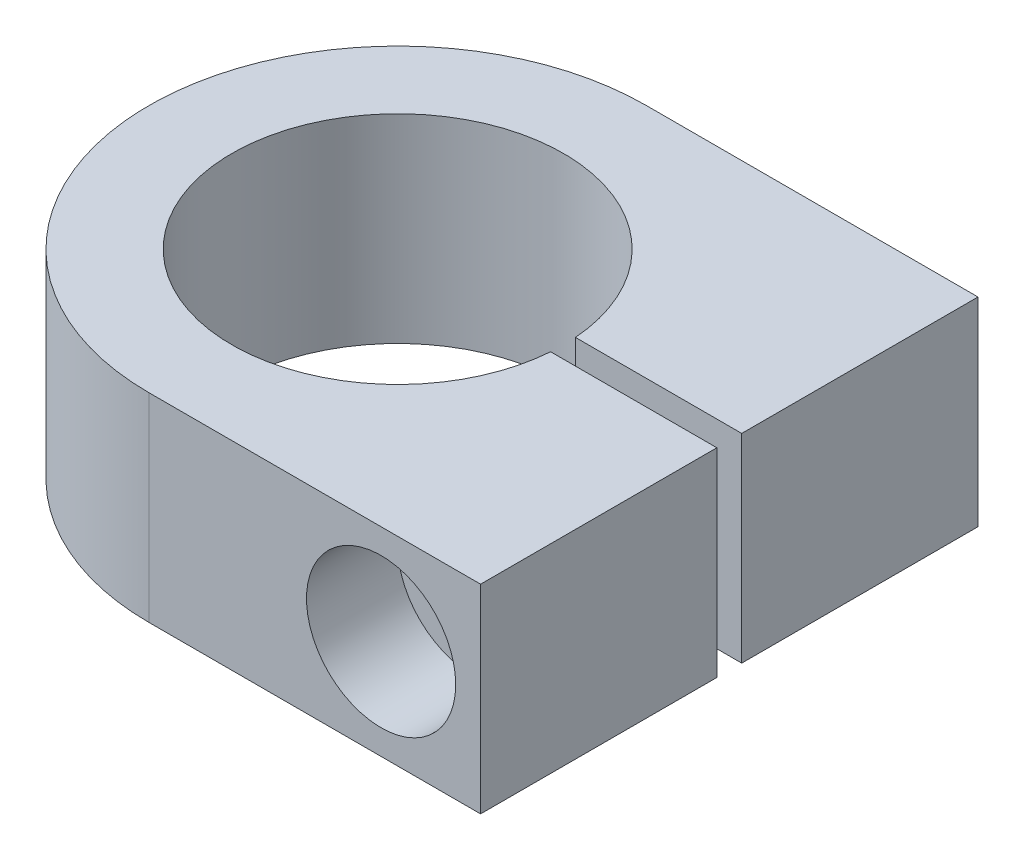
ISO-10303-21;
HEADER;
FILE_DESCRIPTION(('STEP AP214'),'2;1');
FILE_NAME('part.step','',(''),(''),'','','');
FILE_SCHEMA(('AUTOMOTIVE_DESIGN { 1 0 10303 214 1 1 1 1 }'));
ENDSEC;
DATA;
#1=APPLICATION_CONTEXT('core data for automotive mechanical design processes');
#2=APPLICATION_PROTOCOL_DEFINITION('international standard','automotive_design',2000,#1);
#3=PRODUCT_CONTEXT('',#1,'mechanical');
#4=PRODUCT('Part','Part','',(#3));
#5=PRODUCT_RELATED_PRODUCT_CATEGORY('part','',(#4));
#6=PRODUCT_DEFINITION_FORMATION('','',#4);
#7=PRODUCT_DEFINITION_CONTEXT('part definition',#1,'design');
#8=PRODUCT_DEFINITION('design','',#6,#7);
#9=PRODUCT_DEFINITION_SHAPE('','',#8);
#10=(LENGTH_UNIT() NAMED_UNIT(*) SI_UNIT(.MILLI.,.METRE.));
#11=(NAMED_UNIT(*) PLANE_ANGLE_UNIT() SI_UNIT($,.RADIAN.));
#12=(NAMED_UNIT(*) SI_UNIT($,.STERADIAN.) SOLID_ANGLE_UNIT());
#13=UNCERTAINTY_MEASURE_WITH_UNIT(LENGTH_MEASURE(1.E-05),#10,'distance_accuracy_value','');
#14=(GEOMETRIC_REPRESENTATION_CONTEXT(3) GLOBAL_UNCERTAINTY_ASSIGNED_CONTEXT((#13)) GLOBAL_UNIT_ASSIGNED_CONTEXT((#10,
#11,#12)) REPRESENTATION_CONTEXT('',''));
#15=CARTESIAN_POINT('',(0.,0.,0.));
#16=DIRECTION('',(0.,0.,1.));
#17=DIRECTION('',(1.,0.,0.));
#18=AXIS2_PLACEMENT_3D('',#15,#16,#17);
#19=CARTESIAN_POINT('',(-12.,12.,-60.001));
#20=DIRECTION('',(0.,0.,1.));
#21=DIRECTION('',(1.,0.,0.));
#22=AXIS2_PLACEMENT_3D('',#19,#20,#21);
#23=CYLINDRICAL_SURFACE('',#22,5.5);
#24=CARTESIAN_POINT('',(-12.,12.,-28.5));
#25=DIRECTION('',(0.,0.,1.));
#26=DIRECTION('',(1.,0.,0.));
#27=AXIS2_PLACEMENT_3D('',#24,#25,#26);
#28=CIRCLE('',#27,5.5);
#29=CARTESIAN_POINT('',(-6.50000000000001,12.,-28.5));
#30=VERTEX_POINT('',#29);
#31=EDGE_CURVE('E139',#30,#30,#28,.F.);
#32=ORIENTED_EDGE('',*,*,#31,.T.);
#33=EDGE_LOOP('',(#32));
#34=FACE_BOUND('',#33,.T.);
#35=CARTESIAN_POINT('',(-12.,12.,-11.));
#36=DIRECTION('',(0.,0.,1.));
#37=DIRECTION('',(1.,0.,0.));
#38=AXIS2_PLACEMENT_3D('',#35,#36,#37);
#39=CIRCLE('',#38,5.5);
#40=CARTESIAN_POINT('',(-6.50000000000001,12.,-11.));
#41=VERTEX_POINT('',#40);
#42=EDGE_CURVE('E41',#41,#41,#39,.F.);
#43=ORIENTED_EDGE('',*,*,#42,.F.);
#44=EDGE_LOOP('',(#43));
#45=FACE_BOUND('',#44,.T.);
#46=ADVANCED_FACE('F37',(#34,#45),#23,.F.);
#47=CARTESIAN_POINT('',(-40.,24.,0.));
#48=DIRECTION('',(0.,0.,-1.));
#49=DIRECTION('',(-1.,0.,0.));
#50=AXIS2_PLACEMENT_3D('',#47,#48,#49);
#51=PLANE('',#50);
#52=CARTESIAN_POINT('',(-12.,12.,0.));
#53=DIRECTION('',(0.,0.,1.));
#54=DIRECTION('',(1.,0.,0.));
#55=AXIS2_PLACEMENT_3D('',#52,#53,#54);
#56=CIRCLE('',#55,9.);
#57=CARTESIAN_POINT('',(-3.00000000000001,12.,0.));
#58=VERTEX_POINT('',#57);
#59=EDGE_CURVE('E186',#58,#58,#56,.T.);
#60=ORIENTED_EDGE('',*,*,#59,.F.);
#61=EDGE_LOOP('',(#60));
#62=FACE_BOUND('',#61,.T.);
#63=DIRECTION('',(1.,0.,0.));
#64=VECTOR('',#63,1.);
#65=CARTESIAN_POINT('',(-40.,0.,0.));
#66=LINE('',#65,#64);
#67=CARTESIAN_POINT('',(-40.,0.,0.));
#68=VERTEX_POINT('',#67);
#69=CARTESIAN_POINT('',(0.,0.,0.));
#70=VERTEX_POINT('',#69);
#71=EDGE_CURVE('E135',#68,#70,#66,.T.);
#72=ORIENTED_EDGE('',*,*,#71,.T.);
#73=DIRECTION('',(0.,-1.,0.));
#74=VECTOR('',#73,1.);
#75=CARTESIAN_POINT('',(0.,24.,0.));
#76=LINE('',#75,#74);
#77=CARTESIAN_POINT('',(0.,24.,0.));
#78=VERTEX_POINT('',#77);
#79=EDGE_CURVE('E11',#78,#70,#76,.T.);
#80=ORIENTED_EDGE('',*,*,#79,.F.);
#81=DIRECTION('',(1.,0.,0.));
#82=VECTOR('',#81,1.);
#83=CARTESIAN_POINT('',(-40.,24.,0.));
#84=LINE('',#83,#82);
#85=CARTESIAN_POINT('',(-40.,24.,0.));
#86=VERTEX_POINT('',#85);
#87=EDGE_CURVE('E150',#86,#78,#84,.T.);
#88=ORIENTED_EDGE('',*,*,#87,.F.);
#89=DIRECTION('',(0.,-1.,0.));
#90=VECTOR('',#89,1.);
#91=CARTESIAN_POINT('',(-40.,24.,0.));
#92=LINE('',#91,#90);
#93=EDGE_CURVE('E131',#86,#68,#92,.T.);
#94=ORIENTED_EDGE('',*,*,#93,.T.);
#95=EDGE_LOOP('',(#72,#80,#88,#94));
#96=FACE_BOUND('',#95,.T.);
#97=ADVANCED_FACE('F39',(#62,#96),#51,.F.);
#98=CARTESIAN_POINT('',(0.,24.,0.));
#99=DIRECTION('',(-1.,0.,0.));
#100=DIRECTION('',(0.,0.,1.));
#101=AXIS2_PLACEMENT_3D('',#98,#99,#100);
#102=PLANE('',#101);
#103=DIRECTION('',(0.,0.,-1.));
#104=VECTOR('',#103,1.);
#105=CARTESIAN_POINT('',(0.,0.,0.));
#106=LINE('',#105,#104);
#107=CARTESIAN_POINT('',(0.,0.,-28.5));
#108=VERTEX_POINT('',#107);
#109=EDGE_CURVE('E138',#70,#108,#106,.T.);
#110=ORIENTED_EDGE('',*,*,#109,.T.);
#111=DIRECTION('',(0.,-1.,0.));
#112=VECTOR('',#111,1.);
#113=CARTESIAN_POINT('',(0.,24.,-28.5));
#114=LINE('',#113,#112);
#115=CARTESIAN_POINT('',(0.,24.,-28.5));
#116=VERTEX_POINT('',#115);
#117=EDGE_CURVE('E47',#116,#108,#114,.T.);
#118=ORIENTED_EDGE('',*,*,#117,.F.);
#119=DIRECTION('',(0.,0.,-1.));
#120=VECTOR('',#119,1.);
#121=CARTESIAN_POINT('',(0.,24.,0.));
#122=LINE('',#121,#120);
#123=EDGE_CURVE('E98',#78,#116,#122,.T.);
#124=ORIENTED_EDGE('',*,*,#123,.F.);
#125=ORIENTED_EDGE('',*,*,#79,.T.);
#126=EDGE_LOOP('',(#110,#118,#124,#125));
#127=FACE_BOUND('',#126,.T.);
#128=ADVANCED_FACE('F216',(#127),#102,.F.);
#129=CARTESIAN_POINT('',(0.,24.,-28.5));
#130=DIRECTION('',(0.,0.,1.));
#131=DIRECTION('',(1.,0.,0.));
#132=AXIS2_PLACEMENT_3D('',#129,#130,#131);
#133=PLANE('',#132);
#134=ORIENTED_EDGE('',*,*,#31,.F.);
#135=EDGE_LOOP('',(#134));
#136=FACE_BOUND('',#135,.T.);
#137=DIRECTION('',(-1.,0.,0.));
#138=VECTOR('',#137,1.);
#139=CARTESIAN_POINT('',(0.,0.,-28.5));
#140=LINE('',#139,#138);
#141=CARTESIAN_POINT('',(-20.0563293248209,0.,-28.5));
#142=VERTEX_POINT('',#141);
#143=EDGE_CURVE('E141',#108,#142,#140,.T.);
#144=ORIENTED_EDGE('',*,*,#143,.T.);
#145=DIRECTION('',(0.,-1.,0.));
#146=VECTOR('',#145,1.);
#147=CARTESIAN_POINT('',(-20.0563293248209,24.,-28.5));
#148=LINE('',#147,#146);
#149=CARTESIAN_POINT('',(-20.0563293248209,24.,-28.5));
#150=VERTEX_POINT('',#149);
#151=EDGE_CURVE('E157',#150,#142,#148,.T.);
#152=ORIENTED_EDGE('',*,*,#151,.F.);
#153=DIRECTION('',(-1.,0.,0.));
#154=VECTOR('',#153,1.);
#155=CARTESIAN_POINT('',(0.,24.,-28.5));
#156=LINE('',#155,#154);
#157=EDGE_CURVE('E166',#116,#150,#156,.T.);
#158=ORIENTED_EDGE('',*,*,#157,.F.);
#159=ORIENTED_EDGE('',*,*,#117,.T.);
#160=EDGE_LOOP('',(#144,#152,#158,#159));
#161=FACE_BOUND('',#160,.T.);
#162=ADVANCED_FACE('F164',(#136,#161),#133,.F.);
#163=CARTESIAN_POINT('',(-40.,24.,-30.));
#164=DIRECTION('',(0.,-1.,0.));
#165=DIRECTION('',(0.,0.,-1.));
#166=AXIS2_PLACEMENT_3D('',#163,#164,#165);
#167=CYLINDRICAL_SURFACE('',#166,20.);
#168=CARTESIAN_POINT('',(-40.,0.,-30.));
#169=DIRECTION('',(0.,-1.,0.));
#170=DIRECTION('',(0.,0.,1.));
#171=AXIS2_PLACEMENT_3D('',#168,#169,#170);
#172=CIRCLE('',#171,20.);
#173=CARTESIAN_POINT('',(-20.0563293248209,0.,-31.5));
#174=VERTEX_POINT('',#173);
#175=EDGE_CURVE('E143',#142,#174,#172,.T.);
#176=ORIENTED_EDGE('',*,*,#175,.T.);
#177=DIRECTION('',(0.,-1.,0.));
#178=VECTOR('',#177,1.);
#179=CARTESIAN_POINT('',(-20.0563293248209,24.,-31.5));
#180=LINE('',#179,#178);
#181=CARTESIAN_POINT('',(-20.0563293248209,24.,-31.5));
#182=VERTEX_POINT('',#181);
#183=EDGE_CURVE('E154',#182,#174,#180,.T.);
#184=ORIENTED_EDGE('',*,*,#183,.F.);
#185=CARTESIAN_POINT('',(-40.,24.,-30.));
#186=DIRECTION('',(0.,-1.,0.));
#187=DIRECTION('',(0.,0.,1.));
#188=AXIS2_PLACEMENT_3D('',#185,#186,#187);
#189=CIRCLE('',#188,20.);
#190=EDGE_CURVE('E178',#150,#182,#189,.T.);
#191=ORIENTED_EDGE('',*,*,#190,.F.);
#192=ORIENTED_EDGE('',*,*,#151,.T.);
#193=EDGE_LOOP('',(#176,#184,#191,#192));
#194=FACE_BOUND('',#193,.T.);
#195=ADVANCED_FACE('F174',(#194),#167,.F.);
#196=CARTESIAN_POINT('',(-20.0563293248209,24.,-31.5));
#197=DIRECTION('',(0.,0.,-1.));
#198=DIRECTION('',(-1.,0.,0.));
#199=AXIS2_PLACEMENT_3D('',#196,#197,#198);
#200=PLANE('',#199);
#201=CARTESIAN_POINT('',(-12.,12.,-31.5));
#202=DIRECTION('',(0.,0.,-1.));
#203=DIRECTION('',(-1.,0.,0.));
#204=AXIS2_PLACEMENT_3D('',#201,#202,#203);
#205=CIRCLE('',#204,4.24999999999999);
#206=CARTESIAN_POINT('',(-16.25,12.,-31.5));
#207=VERTEX_POINT('',#206);
#208=EDGE_CURVE('E190',#207,#207,#205,.T.);
#209=ORIENTED_EDGE('',*,*,#208,.T.);
#210=EDGE_LOOP('',(#209));
#211=FACE_BOUND('',#210,.T.);
#212=DIRECTION('',(1.,0.,0.));
#213=VECTOR('',#212,1.);
#214=CARTESIAN_POINT('',(-20.0563293248209,0.,-31.5));
#215=LINE('',#214,#213);
#216=CARTESIAN_POINT('',(0.,0.,-31.5));
#217=VERTEX_POINT('',#216);
#218=EDGE_CURVE('E145',#174,#217,#215,.T.);
#219=ORIENTED_EDGE('',*,*,#218,.T.);
#220=DIRECTION('',(0.,-1.,0.));
#221=VECTOR('',#220,1.);
#222=CARTESIAN_POINT('',(0.,24.,-31.5));
#223=LINE('',#222,#221);
#224=CARTESIAN_POINT('',(0.,24.,-31.5));
#225=VERTEX_POINT('',#224);
#226=EDGE_CURVE('E126',#225,#217,#223,.T.);
#227=ORIENTED_EDGE('',*,*,#226,.F.);
#228=DIRECTION('',(1.,0.,0.));
#229=VECTOR('',#228,1.);
#230=CARTESIAN_POINT('',(-20.0563293248209,24.,-31.5));
#231=LINE('',#230,#229);
#232=EDGE_CURVE('E117',#182,#225,#231,.T.);
#233=ORIENTED_EDGE('',*,*,#232,.F.);
#234=ORIENTED_EDGE('',*,*,#183,.T.);
#235=EDGE_LOOP('',(#219,#227,#233,#234));
#236=FACE_BOUND('',#235,.T.);
#237=ADVANCED_FACE('F177',(#211,#236),#200,.F.);
#238=CARTESIAN_POINT('',(0.,24.,-31.5));
#239=DIRECTION('',(-1.,0.,0.));
#240=DIRECTION('',(0.,0.,1.));
#241=AXIS2_PLACEMENT_3D('',#238,#239,#240);
#242=PLANE('',#241);
#243=DIRECTION('',(0.,0.,-1.));
#244=VECTOR('',#243,1.);
#245=CARTESIAN_POINT('',(0.,0.,-31.5));
#246=LINE('',#245,#244);
#247=CARTESIAN_POINT('',(0.,0.,-60.));
#248=VERTEX_POINT('',#247);
#249=EDGE_CURVE('E125',#217,#248,#246,.T.);
#250=ORIENTED_EDGE('',*,*,#249,.T.);
#251=DIRECTION('',(0.,-1.,0.));
#252=VECTOR('',#251,1.);
#253=CARTESIAN_POINT('',(0.,24.,-60.));
#254=LINE('',#253,#252);
#255=CARTESIAN_POINT('',(0.,24.,-60.));
#256=VERTEX_POINT('',#255);
#257=EDGE_CURVE('E122',#256,#248,#254,.T.);
#258=ORIENTED_EDGE('',*,*,#257,.F.);
#259=DIRECTION('',(0.,0.,-1.));
#260=VECTOR('',#259,1.);
#261=CARTESIAN_POINT('',(0.,24.,-31.5));
#262=LINE('',#261,#260);
#263=EDGE_CURVE('E111',#225,#256,#262,.T.);
#264=ORIENTED_EDGE('',*,*,#263,.F.);
#265=ORIENTED_EDGE('',*,*,#226,.T.);
#266=EDGE_LOOP('',(#250,#258,#264,#265));
#267=FACE_BOUND('',#266,.T.);
#268=ADVANCED_FACE('F123',(#267),#242,.F.);
#269=CARTESIAN_POINT('',(0.,24.,-60.));
#270=DIRECTION('',(0.,0.,1.));
#271=DIRECTION('',(1.,0.,0.));
#272=AXIS2_PLACEMENT_3D('',#269,#270,#271);
#273=PLANE('',#272);
#274=CARTESIAN_POINT('',(-12.,12.,-60.));
#275=DIRECTION('',(0.,0.,-1.));
#276=DIRECTION('',(-1.,0.,0.));
#277=AXIS2_PLACEMENT_3D('',#274,#275,#276);
#278=CIRCLE('',#277,4.24999999999999);
#279=CARTESIAN_POINT('',(-16.25,12.,-60.));
#280=VERTEX_POINT('',#279);
#281=EDGE_CURVE('E195',#280,#280,#278,.T.);
#282=ORIENTED_EDGE('',*,*,#281,.F.);
#283=EDGE_LOOP('',(#282));
#284=FACE_BOUND('',#283,.T.);
#285=DIRECTION('',(-1.,0.,0.));
#286=VECTOR('',#285,1.);
#287=CARTESIAN_POINT('',(0.,0.,-60.));
#288=LINE('',#287,#286);
#289=CARTESIAN_POINT('',(-40.,0.,-60.));
#290=VERTEX_POINT('',#289);
#291=EDGE_CURVE('E84',#248,#290,#288,.T.);
#292=ORIENTED_EDGE('',*,*,#291,.T.);
#293=DIRECTION('',(0.,-1.,0.));
#294=VECTOR('',#293,1.);
#295=CARTESIAN_POINT('',(-40.,24.,-60.));
#296=LINE('',#295,#294);
#297=CARTESIAN_POINT('',(-40.,24.,-60.));
#298=VERTEX_POINT('',#297);
#299=EDGE_CURVE('E127',#298,#290,#296,.T.);
#300=ORIENTED_EDGE('',*,*,#299,.F.);
#301=DIRECTION('',(-1.,0.,0.));
#302=VECTOR('',#301,1.);
#303=CARTESIAN_POINT('',(0.,24.,-60.));
#304=LINE('',#303,#302);
#305=EDGE_CURVE('E115',#256,#298,#304,.T.);
#306=ORIENTED_EDGE('',*,*,#305,.F.);
#307=ORIENTED_EDGE('',*,*,#257,.T.);
#308=EDGE_LOOP('',(#292,#300,#306,#307));
#309=FACE_BOUND('',#308,.T.);
#310=ADVANCED_FACE('F129',(#284,#309),#273,.F.);
#311=CARTESIAN_POINT('',(-40.,24.,-30.));
#312=DIRECTION('',(0.,-1.,0.));
#313=DIRECTION('',(0.,0.,-1.));
#314=AXIS2_PLACEMENT_3D('',#311,#312,#313);
#315=CYLINDRICAL_SURFACE('',#314,30.);
#316=CARTESIAN_POINT('',(-40.,0.,-30.));
#317=DIRECTION('',(0.,1.,0.));
#318=DIRECTION('',(0.,0.,1.));
#319=AXIS2_PLACEMENT_3D('',#316,#317,#318);
#320=CIRCLE('',#319,30.);
#321=EDGE_CURVE('E90',#290,#68,#320,.T.);
#322=ORIENTED_EDGE('',*,*,#321,.T.);
#323=ORIENTED_EDGE('',*,*,#93,.F.);
#324=CARTESIAN_POINT('',(-40.,24.,-30.));
#325=DIRECTION('',(0.,1.,0.));
#326=DIRECTION('',(0.,0.,1.));
#327=AXIS2_PLACEMENT_3D('',#324,#325,#326);
#328=CIRCLE('',#327,30.);
#329=EDGE_CURVE('E55',#298,#86,#328,.T.);
#330=ORIENTED_EDGE('',*,*,#329,.F.);
#331=ORIENTED_EDGE('',*,*,#299,.T.);
#332=EDGE_LOOP('',(#322,#323,#330,#331));
#333=FACE_BOUND('',#332,.T.);
#334=ADVANCED_FACE('F202',(#333),#315,.T.);
#335=CARTESIAN_POINT('',(-40.,24.,-30.));
#336=DIRECTION('',(0.,1.,0.));
#337=DIRECTION('',(0.,0.,1.));
#338=AXIS2_PLACEMENT_3D('',#335,#336,#337);
#339=PLANE('',#338);
#340=ORIENTED_EDGE('',*,*,#87,.T.);
#341=ORIENTED_EDGE('',*,*,#123,.T.);
#342=ORIENTED_EDGE('',*,*,#157,.T.);
#343=ORIENTED_EDGE('',*,*,#190,.T.);
#344=ORIENTED_EDGE('',*,*,#232,.T.);
#345=ORIENTED_EDGE('',*,*,#263,.T.);
#346=ORIENTED_EDGE('',*,*,#305,.T.);
#347=ORIENTED_EDGE('',*,*,#329,.T.);
#348=EDGE_LOOP('',(#340,#341,#342,#343,#344,#345,#346,#347));
#349=FACE_BOUND('',#348,.T.);
#350=ADVANCED_FACE('F113',(#349),#339,.T.);
#351=CARTESIAN_POINT('',(-40.,0.,-30.));
#352=DIRECTION('',(0.,1.,0.));
#353=DIRECTION('',(0.,0.,1.));
#354=AXIS2_PLACEMENT_3D('',#351,#352,#353);
#355=PLANE('',#354);
#356=ORIENTED_EDGE('',*,*,#71,.F.);
#357=ORIENTED_EDGE('',*,*,#321,.F.);
#358=ORIENTED_EDGE('',*,*,#291,.F.);
#359=ORIENTED_EDGE('',*,*,#249,.F.);
#360=ORIENTED_EDGE('',*,*,#218,.F.);
#361=ORIENTED_EDGE('',*,*,#175,.F.);
#362=ORIENTED_EDGE('',*,*,#143,.F.);
#363=ORIENTED_EDGE('',*,*,#109,.F.);
#364=EDGE_LOOP('',(#356,#357,#358,#359,#360,#361,#362,#363));
#365=FACE_BOUND('',#364,.T.);
#366=ADVANCED_FACE('F170',(#365),#355,.F.);
#367=CARTESIAN_POINT('',(-12.,12.,-11.));
#368=DIRECTION('',(0.,0.,1.));
#369=DIRECTION('',(1.,0.,0.));
#370=AXIS2_PLACEMENT_3D('',#367,#368,#369);
#371=PLANE('',#370);
#372=CARTESIAN_POINT('',(-12.,12.,-11.));
#373=DIRECTION('',(0.,0.,1.));
#374=DIRECTION('',(1.,0.,0.));
#375=AXIS2_PLACEMENT_3D('',#372,#373,#374);
#376=CIRCLE('',#375,9.);
#377=CARTESIAN_POINT('',(-3.00000000000001,12.,-11.));
#378=VERTEX_POINT('',#377);
#379=EDGE_CURVE('E189',#378,#378,#376,.T.);
#380=ORIENTED_EDGE('',*,*,#379,.T.);
#381=EDGE_LOOP('',(#380));
#382=FACE_BOUND('',#381,.T.);
#383=ORIENTED_EDGE('',*,*,#42,.T.);
#384=EDGE_LOOP('',(#383));
#385=FACE_BOUND('',#384,.T.);
#386=ADVANCED_FACE('F226',(#382,#385),#371,.T.);
#387=CARTESIAN_POINT('',(-12.,12.,-11.));
#388=DIRECTION('',(0.,0.,1.));
#389=DIRECTION('',(1.,0.,0.));
#390=AXIS2_PLACEMENT_3D('',#387,#388,#389);
#391=CYLINDRICAL_SURFACE('',#390,9.);
#392=ORIENTED_EDGE('',*,*,#379,.F.);
#393=EDGE_LOOP('',(#392));
#394=FACE_BOUND('',#393,.T.);
#395=ORIENTED_EDGE('',*,*,#59,.T.);
#396=EDGE_LOOP('',(#395));
#397=FACE_BOUND('',#396,.T.);
#398=ADVANCED_FACE('F221',(#394,#397),#391,.F.);
#399=CARTESIAN_POINT('',(-12.,12.,-60.));
#400=DIRECTION('',(0.,0.,-1.));
#401=DIRECTION('',(-1.,0.,0.));
#402=AXIS2_PLACEMENT_3D('',#399,#400,#401);
#403=CYLINDRICAL_SURFACE('',#402,4.24999999999999);
#404=ORIENTED_EDGE('',*,*,#208,.F.);
#405=EDGE_LOOP('',(#404));
#406=FACE_BOUND('',#405,.T.);
#407=ORIENTED_EDGE('',*,*,#281,.T.);
#408=EDGE_LOOP('',(#407));
#409=FACE_BOUND('',#408,.T.);
#410=ADVANCED_FACE('F199',(#406,#409),#403,.F.);
#411=CLOSED_SHELL('',(#46,#97,#128,#162,#195,#237,#268,#310,#334,#350,#366,#386,#398,#410));
#412=MANIFOLD_SOLID_BREP('B2',#411);
#413=ADVANCED_BREP_SHAPE_REPRESENTATION('',(#18,#412),#14);
#414=SHAPE_DEFINITION_REPRESENTATION(#9,#413);
ENDSEC;
END-ISO-10303-21;
